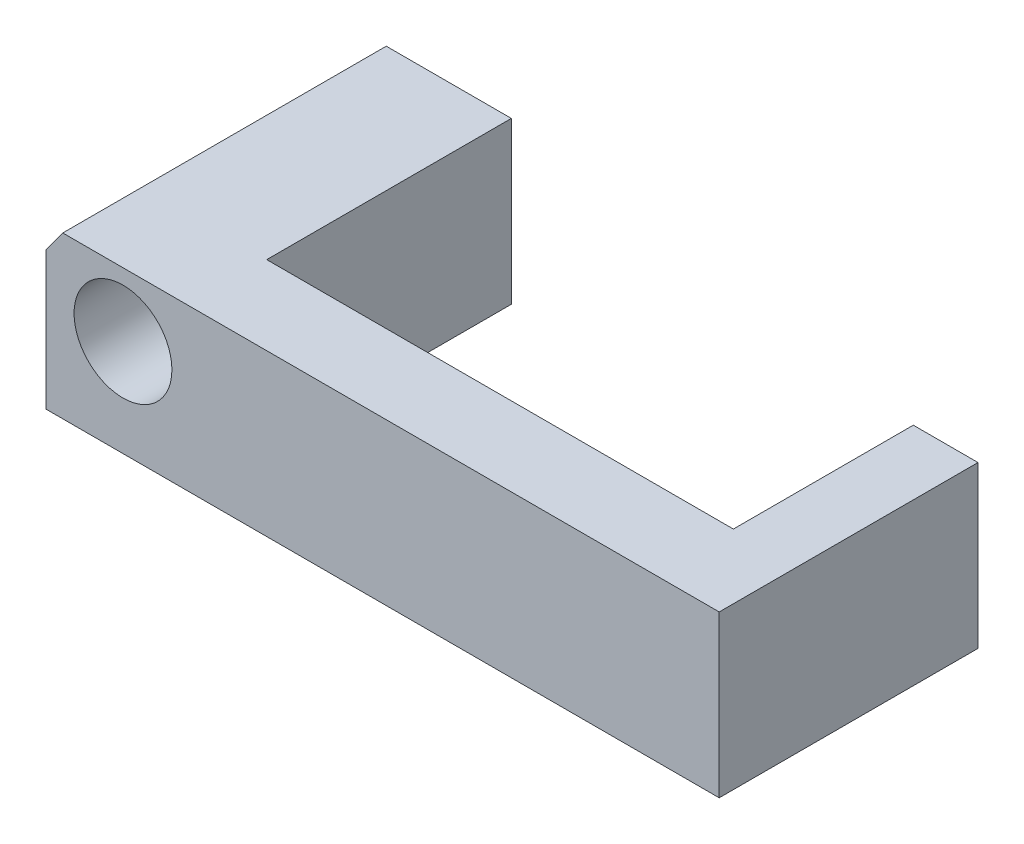
ISO-10303-21;
HEADER;
FILE_DESCRIPTION(('STEP AP214'),'2;1');
FILE_NAME('part.step','',(''),(''),'','','');
FILE_SCHEMA(('AUTOMOTIVE_DESIGN { 1 0 10303 214 1 1 1 1 }'));
ENDSEC;
DATA;
#1=APPLICATION_CONTEXT('core data for automotive mechanical design processes');
#2=APPLICATION_PROTOCOL_DEFINITION('international standard','automotive_design',2000,#1);
#3=PRODUCT_CONTEXT('',#1,'mechanical');
#4=PRODUCT('Part','Part','',(#3));
#5=PRODUCT_RELATED_PRODUCT_CATEGORY('part','',(#4));
#6=PRODUCT_DEFINITION_FORMATION('','',#4);
#7=PRODUCT_DEFINITION_CONTEXT('part definition',#1,'design');
#8=PRODUCT_DEFINITION('design','',#6,#7);
#9=PRODUCT_DEFINITION_SHAPE('','',#8);
#10=(LENGTH_UNIT() NAMED_UNIT(*) SI_UNIT(.MILLI.,.METRE.));
#11=(NAMED_UNIT(*) PLANE_ANGLE_UNIT() SI_UNIT($,.RADIAN.));
#12=(NAMED_UNIT(*) SI_UNIT($,.STERADIAN.) SOLID_ANGLE_UNIT());
#13=UNCERTAINTY_MEASURE_WITH_UNIT(LENGTH_MEASURE(1.E-05),#10,'distance_accuracy_value','');
#14=(GEOMETRIC_REPRESENTATION_CONTEXT(3) GLOBAL_UNCERTAINTY_ASSIGNED_CONTEXT((#13)) GLOBAL_UNIT_ASSIGNED_CONTEXT((#10,
#11,#12)) REPRESENTATION_CONTEXT('',''));
#15=CARTESIAN_POINT('',(0.,0.,0.));
#16=DIRECTION('',(0.,0.,1.));
#17=DIRECTION('',(1.,0.,0.));
#18=AXIS2_PLACEMENT_3D('',#15,#16,#17);
#19=CARTESIAN_POINT('',(-89.85,-63.5,15.875));
#20=DIRECTION('',(-1.,0.,0.));
#21=DIRECTION('',(0.,0.,1.));
#22=AXIS2_PLACEMENT_3D('',#19,#20,#21);
#23=PLANE('',#22);
#24=DIRECTION('',(0.,1.,0.));
#25=VECTOR('',#24,1.);
#26=CARTESIAN_POINT('',(-89.85,-63.5,12.00423));
#27=LINE('',#26,#25);
#28=CARTESIAN_POINT('',(-89.85,-63.5,12.00423));
#29=VERTEX_POINT('',#28);
#30=CARTESIAN_POINT('',(-89.85,-55.5999999999998,12.00423));
#31=VERTEX_POINT('',#30);
#32=EDGE_CURVE('E49',#29,#31,#27,.T.);
#33=ORIENTED_EDGE('',*,*,#32,.F.);
#34=DIRECTION('',(0.,0.,-1.));
#35=VECTOR('',#34,1.);
#36=CARTESIAN_POINT('',(-89.85,-63.5,15.875));
#37=LINE('',#36,#35);
#38=CARTESIAN_POINT('',(-89.85,-63.5,0.));
#39=VERTEX_POINT('',#38);
#40=EDGE_CURVE('E41',#29,#39,#37,.T.);
#41=ORIENTED_EDGE('',*,*,#40,.T.);
#42=DIRECTION('',(0.,1.,0.));
#43=VECTOR('',#42,1.);
#44=CARTESIAN_POINT('',(-89.85,-63.5,0.));
#45=LINE('',#44,#43);
#46=CARTESIAN_POINT('',(-89.85,-55.5999999999999,0.));
#47=VERTEX_POINT('',#46);
#48=EDGE_CURVE('E192',#39,#47,#45,.T.);
#49=ORIENTED_EDGE('',*,*,#48,.T.);
#50=DIRECTION('',(0.,0.,-1.));
#51=VECTOR('',#50,1.);
#52=CARTESIAN_POINT('',(-89.85,-55.5999999999999,15.875));
#53=LINE('',#52,#51);
#54=EDGE_CURVE('E179',#31,#47,#53,.T.);
#55=ORIENTED_EDGE('',*,*,#54,.F.);
#56=EDGE_LOOP('',(#33,#41,#49,#55));
#57=FACE_BOUND('',#56,.T.);
#58=ADVANCED_FACE('F32',(#57),#23,.F.);
#59=CARTESIAN_POINT('',(-96.8112372679266,-63.5,15.875));
#60=DIRECTION('',(1.,0.,0.));
#61=DIRECTION('',(0.,0.,-1.));
#62=AXIS2_PLACEMENT_3D('',#59,#60,#61);
#63=PLANE('',#62);
#64=DIRECTION('',(0.,-1.,0.));
#65=VECTOR('',#64,1.);
#66=CARTESIAN_POINT('',(-96.8112372679266,-63.5,0.));
#67=LINE('',#66,#65);
#68=CARTESIAN_POINT('',(-96.8112372679266,-56.731076243399,0.));
#69=VERTEX_POINT('',#68);
#70=CARTESIAN_POINT('',(-96.8112372679266,-63.5,0.));
#71=VERTEX_POINT('',#70);
#72=EDGE_CURVE('E170',#69,#71,#67,.T.);
#73=ORIENTED_EDGE('',*,*,#72,.T.);
#74=DIRECTION('',(0.,0.,-1.));
#75=VECTOR('',#74,1.);
#76=CARTESIAN_POINT('',(-96.8112372679266,-63.5,15.875));
#77=LINE('',#76,#75);
#78=CARTESIAN_POINT('',(-96.8112372679266,-63.5,15.875));
#79=VERTEX_POINT('',#78);
#80=EDGE_CURVE('E11',#79,#71,#77,.T.);
#81=ORIENTED_EDGE('',*,*,#80,.F.);
#82=DIRECTION('',(0.,-1.,0.));
#83=VECTOR('',#82,1.);
#84=CARTESIAN_POINT('',(-96.8112372679266,-63.5,15.875));
#85=LINE('',#84,#83);
#86=CARTESIAN_POINT('',(-96.8112372679266,-56.731076243399,15.875));
#87=VERTEX_POINT('',#86);
#88=EDGE_CURVE('E189',#87,#79,#85,.T.);
#89=ORIENTED_EDGE('',*,*,#88,.F.);
#90=DIRECTION('',(0.,0.,-1.));
#91=VECTOR('',#90,1.);
#92=CARTESIAN_POINT('',(-96.8112372679266,-56.731076243399,15.875));
#93=LINE('',#92,#91);
#94=EDGE_CURVE('E186',#87,#69,#93,.T.);
#95=ORIENTED_EDGE('',*,*,#94,.T.);
#96=EDGE_LOOP('',(#73,#81,#89,#95));
#97=FACE_BOUND('',#96,.T.);
#98=ADVANCED_FACE('F34',(#97),#63,.F.);
#99=CARTESIAN_POINT('',(-96.8112372679266,-63.5,15.875));
#100=DIRECTION('',(0.,1.,0.));
#101=DIRECTION('',(-1.,0.,0.));
#102=AXIS2_PLACEMENT_3D('',#99,#100,#101);
#103=PLANE('',#102);
#104=DIRECTION('',(1.,0.,0.));
#105=VECTOR('',#104,1.);
#106=CARTESIAN_POINT('',(-96.8112372679266,-63.5,0.));
#107=LINE('',#106,#105);
#108=EDGE_CURVE('E172',#71,#39,#107,.T.);
#109=ORIENTED_EDGE('',*,*,#108,.T.);
#110=ORIENTED_EDGE('',*,*,#40,.F.);
#111=DIRECTION('',(-1.,0.,0.));
#112=VECTOR('',#111,1.);
#113=CARTESIAN_POINT('',(-58.1526787944908,-63.5,12.00423));
#114=LINE('',#113,#112);
#115=CARTESIAN_POINT('',(-66.95,-63.5,12.00423));
#116=VERTEX_POINT('',#115);
#117=EDGE_CURVE('E120',#116,#29,#114,.T.);
#118=ORIENTED_EDGE('',*,*,#117,.F.);
#119=DIRECTION('',(0.,0.,1.));
#120=VECTOR('',#119,1.);
#121=CARTESIAN_POINT('',(-66.95,-63.5,3.175));
#122=LINE('',#121,#120);
#123=CARTESIAN_POINT('',(-66.95,-63.5,3.175));
#124=VERTEX_POINT('',#123);
#125=EDGE_CURVE('E114',#124,#116,#122,.T.);
#126=ORIENTED_EDGE('',*,*,#125,.F.);
#127=DIRECTION('',(1.,0.,0.));
#128=VECTOR('',#127,1.);
#129=CARTESIAN_POINT('',(-66.95,-63.5,3.175));
#130=LINE('',#129,#128);
#131=CARTESIAN_POINT('',(-63.775,-63.5,3.175));
#132=VERTEX_POINT('',#131);
#133=EDGE_CURVE('E118',#124,#132,#130,.T.);
#134=ORIENTED_EDGE('',*,*,#133,.T.);
#135=DIRECTION('',(0.,0.,1.));
#136=VECTOR('',#135,1.);
#137=CARTESIAN_POINT('',(-63.775,-63.5,3.175));
#138=LINE('',#137,#136);
#139=CARTESIAN_POINT('',(-63.775,-63.5,15.875));
#140=VERTEX_POINT('',#139);
#141=EDGE_CURVE('E124',#132,#140,#138,.T.);
#142=ORIENTED_EDGE('',*,*,#141,.T.);
#143=DIRECTION('',(1.,0.,0.));
#144=VECTOR('',#143,1.);
#145=CARTESIAN_POINT('',(-96.8112372679266,-63.5,15.875));
#146=LINE('',#145,#144);
#147=EDGE_CURVE('E86',#79,#140,#146,.T.);
#148=ORIENTED_EDGE('',*,*,#147,.F.);
#149=ORIENTED_EDGE('',*,*,#80,.T.);
#150=EDGE_LOOP('',(#109,#110,#118,#126,#134,#142,#148,#149));
#151=FACE_BOUND('',#150,.T.);
#152=ADVANCED_FACE('F117',(#151),#103,.F.);
#153=CARTESIAN_POINT('',(-95.988636363637,-55.6000000000007,15.875));
#154=DIRECTION('',(1.29991866544862E-13,-1.,0.));
#155=DIRECTION('',(1.,1.29991866544862E-13,0.));
#156=AXIS2_PLACEMENT_3D('',#153,#154,#155);
#157=PLANE('',#156);
#158=DIRECTION('',(-1.,-1.29991866544862E-13,0.));
#159=VECTOR('',#158,1.);
#160=CARTESIAN_POINT('',(-95.988636363637,-55.6000000000007,0.));
#161=LINE('',#160,#159);
#162=CARTESIAN_POINT('',(-95.988636363637,-55.6000000000007,0.));
#163=VERTEX_POINT('',#162);
#164=EDGE_CURVE('E190',#47,#163,#161,.T.);
#165=ORIENTED_EDGE('',*,*,#164,.T.);
#166=DIRECTION('',(0.,0.,-1.));
#167=VECTOR('',#166,1.);
#168=CARTESIAN_POINT('',(-95.988636363637,-55.6000000000007,15.875));
#169=LINE('',#168,#167);
#170=CARTESIAN_POINT('',(-95.988636363637,-55.6000000000007,15.875));
#171=VERTEX_POINT('',#170);
#172=EDGE_CURVE('E184',#171,#163,#169,.T.);
#173=ORIENTED_EDGE('',*,*,#172,.F.);
#174=DIRECTION('',(-1.,-1.29991866544862E-13,0.));
#175=VECTOR('',#174,1.);
#176=CARTESIAN_POINT('',(-95.988636363637,-55.6000000000007,15.875));
#177=LINE('',#176,#175);
#178=CARTESIAN_POINT('',(-63.775,-55.5999999999998,15.875));
#179=VERTEX_POINT('',#178);
#180=EDGE_CURVE('E197',#179,#171,#177,.T.);
#181=ORIENTED_EDGE('',*,*,#180,.F.);
#182=DIRECTION('',(0.,0.,1.));
#183=VECTOR('',#182,1.);
#184=CARTESIAN_POINT('',(-63.775,-55.5999999999998,3.175));
#185=LINE('',#184,#183);
#186=CARTESIAN_POINT('',(-63.775,-55.5999999999998,3.175));
#187=VERTEX_POINT('',#186);
#188=EDGE_CURVE('E151',#187,#179,#185,.T.);
#189=ORIENTED_EDGE('',*,*,#188,.F.);
#190=DIRECTION('',(-1.,0.,0.));
#191=VECTOR('',#190,1.);
#192=CARTESIAN_POINT('',(-66.95,-55.5999999999998,3.175));
#193=LINE('',#192,#191);
#194=CARTESIAN_POINT('',(-66.95,-55.5999999999998,3.175));
#195=VERTEX_POINT('',#194);
#196=EDGE_CURVE('E125',#187,#195,#193,.T.);
#197=ORIENTED_EDGE('',*,*,#196,.T.);
#198=DIRECTION('',(0.,0.,1.));
#199=VECTOR('',#198,1.);
#200=CARTESIAN_POINT('',(-66.95,-55.5999999999998,3.175));
#201=LINE('',#200,#199);
#202=CARTESIAN_POINT('',(-66.95,-55.5999999999998,12.00423));
#203=VERTEX_POINT('',#202);
#204=EDGE_CURVE('E139',#195,#203,#201,.T.);
#205=ORIENTED_EDGE('',*,*,#204,.T.);
#206=DIRECTION('',(-1.,0.,0.));
#207=VECTOR('',#206,1.);
#208=CARTESIAN_POINT('',(-58.1526787944908,-55.5999999999998,12.00423));
#209=LINE('',#208,#207);
#210=EDGE_CURVE('E164',#203,#31,#209,.T.);
#211=ORIENTED_EDGE('',*,*,#210,.T.);
#212=ORIENTED_EDGE('',*,*,#54,.T.);
#213=EDGE_LOOP('',(#165,#173,#181,#189,#197,#205,#211,#212));
#214=FACE_BOUND('',#213,.T.);
#215=ADVANCED_FACE('F208',(#214),#157,.F.);
#216=CARTESIAN_POINT('',(-95.988636363637,-55.6000000000007,15.875));
#217=DIRECTION('',(0.80873608430319,-0.588171697675045,0.));
#218=DIRECTION('',(0.588171697675045,0.80873608430319,0.));
#219=AXIS2_PLACEMENT_3D('',#216,#217,#218);
#220=PLANE('',#219);
#221=DIRECTION('',(-0.588171697675044,-0.80873608430319,0.));
#222=VECTOR('',#221,1.);
#223=CARTESIAN_POINT('',(-95.988636363637,-55.6000000000007,0.));
#224=LINE('',#223,#222);
#225=EDGE_CURVE('E80',#163,#69,#224,.T.);
#226=ORIENTED_EDGE('',*,*,#225,.T.);
#227=ORIENTED_EDGE('',*,*,#94,.F.);
#228=DIRECTION('',(-0.588171697675044,-0.80873608430319,0.));
#229=VECTOR('',#228,1.);
#230=CARTESIAN_POINT('',(-95.988636363637,-55.6000000000007,15.875));
#231=LINE('',#230,#229);
#232=EDGE_CURVE('E58',#171,#87,#231,.T.);
#233=ORIENTED_EDGE('',*,*,#232,.F.);
#234=ORIENTED_EDGE('',*,*,#172,.T.);
#235=EDGE_LOOP('',(#226,#227,#233,#234));
#236=FACE_BOUND('',#235,.T.);
#237=ADVANCED_FACE('F210',(#236),#220,.F.);
#238=CARTESIAN_POINT('',(0.,0.,15.875));
#239=DIRECTION('',(0.,0.,-1.));
#240=DIRECTION('',(-1.,0.,0.));
#241=AXIS2_PLACEMENT_3D('',#238,#239,#240);
#242=PLANE('',#241);
#243=CARTESIAN_POINT('',(-93.0327515550419,-58.7375000000006,15.875));
#244=DIRECTION('',(0.,0.,1.));
#245=DIRECTION('',(1.,0.,0.));
#246=AXIS2_PLACEMENT_3D('',#243,#244,#245);
#247=CIRCLE('',#246,2.40030000000111);
#248=CARTESIAN_POINT('',(-90.6324515550408,-58.7375000000006,15.875));
#249=VERTEX_POINT('',#248);
#250=EDGE_CURVE('E145',#249,#249,#247,.T.);
#251=ORIENTED_EDGE('',*,*,#250,.F.);
#252=EDGE_LOOP('',(#251));
#253=FACE_BOUND('',#252,.T.);
#254=ORIENTED_EDGE('',*,*,#88,.T.);
#255=ORIENTED_EDGE('',*,*,#147,.T.);
#256=DIRECTION('',(0.,1.,0.));
#257=VECTOR('',#256,1.);
#258=CARTESIAN_POINT('',(-63.775,-63.5,15.875));
#259=LINE('',#258,#257);
#260=EDGE_CURVE('E140',#140,#179,#259,.T.);
#261=ORIENTED_EDGE('',*,*,#260,.T.);
#262=ORIENTED_EDGE('',*,*,#180,.T.);
#263=ORIENTED_EDGE('',*,*,#232,.T.);
#264=EDGE_LOOP('',(#254,#255,#261,#262,#263));
#265=FACE_BOUND('',#264,.T.);
#266=ADVANCED_FACE('F201',(#253,#265),#242,.F.);
#267=CARTESIAN_POINT('',(0.,0.,0.));
#268=DIRECTION('',(0.,0.,-1.));
#269=DIRECTION('',(-1.,0.,0.));
#270=AXIS2_PLACEMENT_3D('',#267,#268,#269);
#271=PLANE('',#270);
#272=CARTESIAN_POINT('',(-93.0327515550419,-58.7375000000006,0.));
#273=DIRECTION('',(0.,0.,-1.));
#274=DIRECTION('',(-1.,0.,0.));
#275=AXIS2_PLACEMENT_3D('',#272,#273,#274);
#276=CIRCLE('',#275,2.40030000000111);
#277=CARTESIAN_POINT('',(-95.433051555043,-58.7375000000006,0.));
#278=VERTEX_POINT('',#277);
#279=EDGE_CURVE('E36',#278,#278,#276,.T.);
#280=ORIENTED_EDGE('',*,*,#279,.F.);
#281=EDGE_LOOP('',(#280));
#282=FACE_BOUND('',#281,.T.);
#283=ORIENTED_EDGE('',*,*,#72,.F.);
#284=ORIENTED_EDGE('',*,*,#225,.F.);
#285=ORIENTED_EDGE('',*,*,#164,.F.);
#286=ORIENTED_EDGE('',*,*,#48,.F.);
#287=ORIENTED_EDGE('',*,*,#108,.F.);
#288=EDGE_LOOP('',(#283,#284,#285,#286,#287));
#289=FACE_BOUND('',#288,.T.);
#290=ADVANCED_FACE('F207',(#282,#289),#271,.T.);
#291=CARTESIAN_POINT('',(-58.1526787944908,-63.5,12.00423));
#292=DIRECTION('',(0.,0.,1.));
#293=DIRECTION('',(1.,0.,0.));
#294=AXIS2_PLACEMENT_3D('',#291,#292,#293);
#295=PLANE('',#294);
#296=DIRECTION('',(0.,1.,0.));
#297=VECTOR('',#296,1.);
#298=CARTESIAN_POINT('',(-66.95,-63.5,12.00423));
#299=LINE('',#298,#297);
#300=EDGE_CURVE('E169',#116,#203,#299,.T.);
#301=ORIENTED_EDGE('',*,*,#300,.F.);
#302=ORIENTED_EDGE('',*,*,#117,.T.);
#303=ORIENTED_EDGE('',*,*,#32,.T.);
#304=ORIENTED_EDGE('',*,*,#210,.F.);
#305=EDGE_LOOP('',(#301,#302,#303,#304));
#306=FACE_BOUND('',#305,.T.);
#307=ADVANCED_FACE('F242',(#306),#295,.F.);
#308=CARTESIAN_POINT('',(-66.95,-63.5,3.175));
#309=DIRECTION('',(-1.,0.,0.));
#310=DIRECTION('',(0.,0.,1.));
#311=AXIS2_PLACEMENT_3D('',#308,#309,#310);
#312=PLANE('',#311);
#313=ORIENTED_EDGE('',*,*,#125,.T.);
#314=ORIENTED_EDGE('',*,*,#300,.T.);
#315=ORIENTED_EDGE('',*,*,#204,.F.);
#316=DIRECTION('',(0.,-1.,0.));
#317=VECTOR('',#316,1.);
#318=CARTESIAN_POINT('',(-66.95,-63.5,3.175));
#319=LINE('',#318,#317);
#320=EDGE_CURVE('E132',#195,#124,#319,.T.);
#321=ORIENTED_EDGE('',*,*,#320,.T.);
#322=EDGE_LOOP('',(#313,#314,#315,#321));
#323=FACE_BOUND('',#322,.T.);
#324=ADVANCED_FACE('F137',(#323),#312,.T.);
#325=CARTESIAN_POINT('',(-63.775,-63.5,3.175));
#326=DIRECTION('',(1.,0.,0.));
#327=DIRECTION('',(0.,0.,-1.));
#328=AXIS2_PLACEMENT_3D('',#325,#326,#327);
#329=PLANE('',#328);
#330=ORIENTED_EDGE('',*,*,#260,.F.);
#331=ORIENTED_EDGE('',*,*,#141,.F.);
#332=DIRECTION('',(0.,1.,0.));
#333=VECTOR('',#332,1.);
#334=CARTESIAN_POINT('',(-63.775,-63.5,3.175));
#335=LINE('',#334,#333);
#336=EDGE_CURVE('E135',#132,#187,#335,.T.);
#337=ORIENTED_EDGE('',*,*,#336,.T.);
#338=ORIENTED_EDGE('',*,*,#188,.T.);
#339=EDGE_LOOP('',(#330,#331,#337,#338));
#340=FACE_BOUND('',#339,.T.);
#341=ADVANCED_FACE('F258',(#340),#329,.T.);
#342=CARTESIAN_POINT('',(0.,0.,3.175));
#343=DIRECTION('',(0.,0.,-1.));
#344=DIRECTION('',(-1.,0.,0.));
#345=AXIS2_PLACEMENT_3D('',#342,#343,#344);
#346=PLANE('',#345);
#347=ORIENTED_EDGE('',*,*,#320,.F.);
#348=ORIENTED_EDGE('',*,*,#196,.F.);
#349=ORIENTED_EDGE('',*,*,#336,.F.);
#350=ORIENTED_EDGE('',*,*,#133,.F.);
#351=EDGE_LOOP('',(#347,#348,#349,#350));
#352=FACE_BOUND('',#351,.T.);
#353=ADVANCED_FACE('F130',(#352),#346,.T.);
#354=CARTESIAN_POINT('',(-93.0327515550419,-58.7375000000006,-2.50000000007189E-05));
#355=DIRECTION('',(0.,0.,1.));
#356=DIRECTION('',(1.,0.,0.));
#357=AXIS2_PLACEMENT_3D('',#354,#355,#356);
#358=CYLINDRICAL_SURFACE('',#357,2.40030000000111);
#359=ORIENTED_EDGE('',*,*,#279,.T.);
#360=EDGE_LOOP('',(#359));
#361=FACE_BOUND('',#360,.T.);
#362=ORIENTED_EDGE('',*,*,#250,.T.);
#363=EDGE_LOOP('',(#362));
#364=FACE_BOUND('',#363,.T.);
#365=ADVANCED_FACE('F276',(#361,#364),#358,.F.);
#366=CLOSED_SHELL('',(#58,#98,#152,#215,#237,#266,#290,#307,#324,#341,#353,#365));
#367=MANIFOLD_SOLID_BREP('B2',#366);
#368=ADVANCED_BREP_SHAPE_REPRESENTATION('',(#18,#367),#14);
#369=SHAPE_DEFINITION_REPRESENTATION(#9,#368);
ENDSEC;
END-ISO-10303-21;
